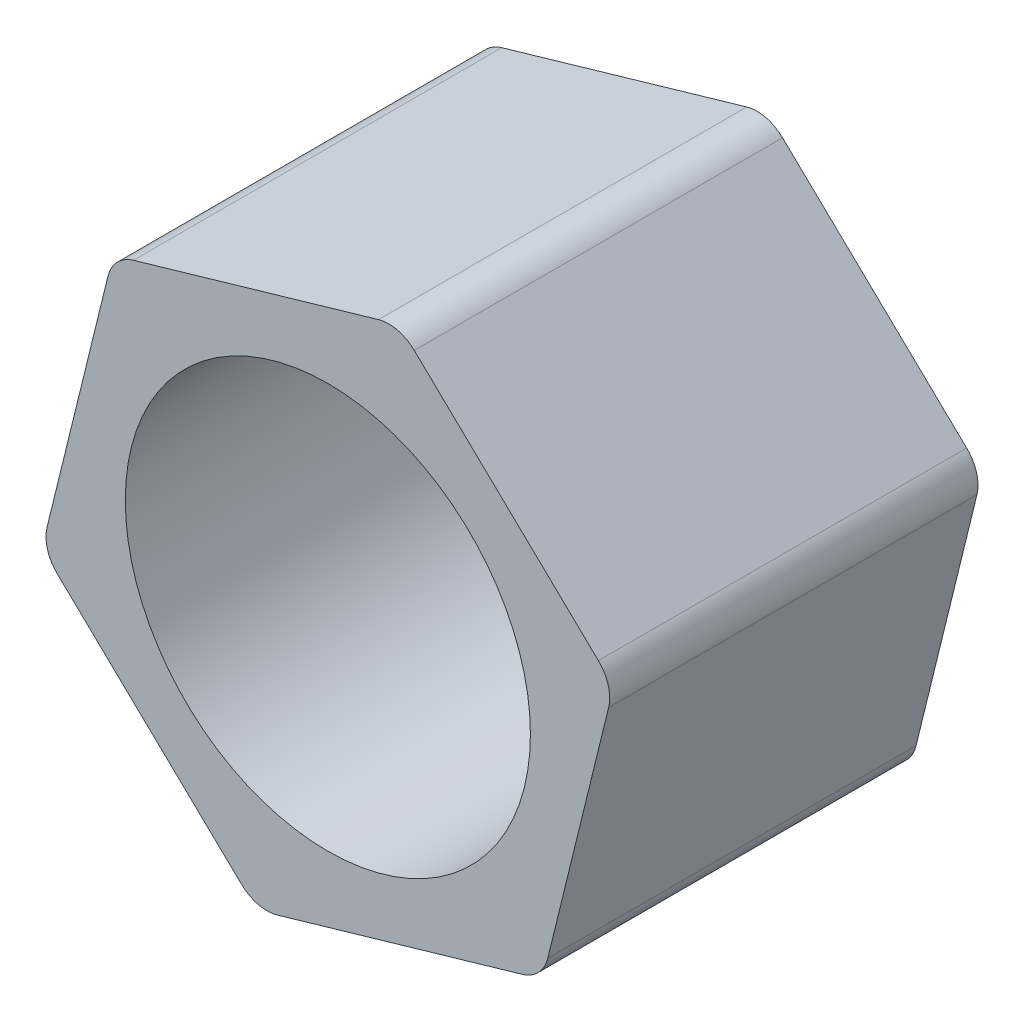
ISO-10303-21;
HEADER;
FILE_DESCRIPTION(('STEP AP214'),'2;1');
FILE_NAME('part.step','',(''),(''),'','','');
FILE_SCHEMA(('AUTOMOTIVE_DESIGN { 1 0 10303 214 1 1 1 1 }'));
ENDSEC;
DATA;
#1=APPLICATION_CONTEXT('core data for automotive mechanical design processes');
#2=APPLICATION_PROTOCOL_DEFINITION('international standard','automotive_design',2000,#1);
#3=PRODUCT_CONTEXT('',#1,'mechanical');
#4=PRODUCT('Part','Part','',(#3));
#5=PRODUCT_RELATED_PRODUCT_CATEGORY('part','',(#4));
#6=PRODUCT_DEFINITION_FORMATION('','',#4);
#7=PRODUCT_DEFINITION_CONTEXT('part definition',#1,'design');
#8=PRODUCT_DEFINITION('design','',#6,#7);
#9=PRODUCT_DEFINITION_SHAPE('','',#8);
#10=(LENGTH_UNIT() NAMED_UNIT(*) SI_UNIT(.MILLI.,.METRE.));
#11=(NAMED_UNIT(*) PLANE_ANGLE_UNIT() SI_UNIT($,.RADIAN.));
#12=(NAMED_UNIT(*) SI_UNIT($,.STERADIAN.) SOLID_ANGLE_UNIT());
#13=UNCERTAINTY_MEASURE_WITH_UNIT(LENGTH_MEASURE(1.E-05),#10,'distance_accuracy_value','');
#14=(GEOMETRIC_REPRESENTATION_CONTEXT(3) GLOBAL_UNCERTAINTY_ASSIGNED_CONTEXT((#13)) GLOBAL_UNIT_ASSIGNED_CONTEXT((#10,
#11,#12)) REPRESENTATION_CONTEXT('',''));
#15=CARTESIAN_POINT('',(0.,0.,0.));
#16=DIRECTION('',(0.,0.,1.));
#17=DIRECTION('',(1.,0.,0.));
#18=AXIS2_PLACEMENT_3D('',#15,#16,#17);
#19=CARTESIAN_POINT('',(0.,0.,20.));
#20=DIRECTION('',(0.,0.,1.));
#21=DIRECTION('',(1.,0.,0.));
#22=AXIS2_PLACEMENT_3D('',#19,#20,#21);
#23=PLANE('',#22);
#24=DIRECTION('',(0.721661581007449,-0.692246027433765,0.));
#25=VECTOR('',#24,1.);
#26=CARTESIAN_POINT('',(-15.5245654968912,-4.50790411012362,20.));
#27=LINE('',#26,#25);
#28=CARTESIAN_POINT('',(-14.6912624807742,-5.30724097069229,20.));
#29=VERTEX_POINT('',#28);
#30=CARTESIAN_POINT('',(-4.69162628737118,-14.8992832975163,20.));
#31=VERTEX_POINT('',#30);
#32=EDGE_CURVE('E217',#29,#31,#27,.T.);
#33=ORIENTED_EDGE('',*,*,#32,.T.);
#34=CARTESIAN_POINT('',(-3.30713423250365,-13.4559601355014,20.));
#35=DIRECTION('',(0.,0.,1.));
#36=DIRECTION('',(1.,0.,0.));
#37=AXIS2_PLACEMENT_3D('',#34,#35,#36);
#38=CIRCLE('',#37,2.);
#39=CARTESIAN_POINT('',(-2.74942573576203,-15.3766270073618,20.));
#40=VERTEX_POINT('',#39);
#41=EDGE_CURVE('E273',#31,#40,#38,.T.);
#42=ORIENTED_EDGE('',*,*,#41,.T.);
#43=DIRECTION('',(0.960333435930224,0.27885424837081,0.));
#44=VECTOR('',#43,1.);
#45=CARTESIAN_POINT('',(-3.85832327125425,-15.698620158085,20.));
#46=LINE('',#45,#44);
#47=CARTESIAN_POINT('',(10.5573446901447,-11.5127091986844,20.));
#48=VERTEX_POINT('',#47);
#49=EDGE_CURVE('E192',#40,#48,#46,.T.);
#50=ORIENTED_EDGE('',*,*,#49,.T.);
#51=CARTESIAN_POINT('',(9.99963619340309,-9.59204232682399,20.));
#52=DIRECTION('',(0.,0.,1.));
#53=DIRECTION('',(1.,0.,0.));
#54=AXIS2_PLACEMENT_3D('',#51,#52,#53);
#55=CIRCLE('',#54,2.);
#56=CARTESIAN_POINT('',(11.9418367450122,-10.0693860366695,20.));
#57=VERTEX_POINT('',#56);
#58=EDGE_CURVE('E267',#48,#57,#55,.T.);
#59=ORIENTED_EDGE('',*,*,#58,.T.);
#60=DIRECTION('',(0.238671854922775,0.971100275804575,0.));
#61=VECTOR('',#60,1.);
#62=CARTESIAN_POINT('',(11.6662422256369,-11.1907160479613,20.));
#63=LINE('',#62,#61);
#64=CARTESIAN_POINT('',(15.2489709775159,3.38657409883183,20.));
#65=VERTEX_POINT('',#64);
#66=EDGE_CURVE('E307',#57,#65,#63,.T.);
#67=ORIENTED_EDGE('',*,*,#66,.T.);
#68=CARTESIAN_POINT('',(13.3067704259067,3.86391780867738,20.));
#69=DIRECTION('',(0.,0.,1.));
#70=DIRECTION('',(1.,0.,0.));
#71=AXIS2_PLACEMENT_3D('',#68,#69,#70);
#72=CIRCLE('',#71,2.);
#73=CARTESIAN_POINT('',(14.6912624807743,5.30724097069228,20.));
#74=VERTEX_POINT('',#73);
#75=EDGE_CURVE('E317',#65,#74,#72,.T.);
#76=ORIENTED_EDGE('',*,*,#75,.T.);
#77=DIRECTION('',(-0.721661581007449,0.692246027433765,0.));
#78=VECTOR('',#77,1.);
#79=CARTESIAN_POINT('',(15.5245654968912,4.50790411012362,20.));
#80=LINE('',#79,#78);
#81=CARTESIAN_POINT('',(4.69162628737118,14.8992832975163,20.));
#82=VERTEX_POINT('',#81);
#83=EDGE_CURVE('E256',#74,#82,#80,.T.);
#84=ORIENTED_EDGE('',*,*,#83,.T.);
#85=CARTESIAN_POINT('',(3.30713423250365,13.4559601355014,20.));
#86=DIRECTION('',(0.,0.,1.));
#87=DIRECTION('',(1.,0.,0.));
#88=AXIS2_PLACEMENT_3D('',#85,#86,#87);
#89=CIRCLE('',#88,2.);
#90=CARTESIAN_POINT('',(2.74942573576203,15.3766270073618,20.));
#91=VERTEX_POINT('',#90);
#92=EDGE_CURVE('E320',#82,#91,#89,.T.);
#93=ORIENTED_EDGE('',*,*,#92,.T.);
#94=DIRECTION('',(-0.960333435930225,-0.27885424837081,0.));
#95=VECTOR('',#94,1.);
#96=CARTESIAN_POINT('',(3.85832327125426,15.6986201580849,20.));
#97=LINE('',#96,#95);
#98=CARTESIAN_POINT('',(-10.5573446901447,11.5127091986844,20.));
#99=VERTEX_POINT('',#98);
#100=EDGE_CURVE('E252',#91,#99,#97,.T.);
#101=ORIENTED_EDGE('',*,*,#100,.T.);
#102=CARTESIAN_POINT('',(-9.99963619340308,9.592042326824,20.));
#103=DIRECTION('',(0.,0.,1.));
#104=DIRECTION('',(1.,0.,0.));
#105=AXIS2_PLACEMENT_3D('',#102,#103,#104);
#106=CIRCLE('',#105,2.);
#107=CARTESIAN_POINT('',(-11.9418367450122,10.0693860366695,20.));
#108=VERTEX_POINT('',#107);
#109=EDGE_CURVE('E82',#99,#108,#106,.T.);
#110=ORIENTED_EDGE('',*,*,#109,.T.);
#111=DIRECTION('',(-0.238671854922776,-0.971100275804575,0.));
#112=VECTOR('',#111,1.);
#113=CARTESIAN_POINT('',(-11.6662422256369,11.1907160479613,20.));
#114=LINE('',#113,#112);
#115=CARTESIAN_POINT('',(-15.2489709775159,-3.38657409883184,20.));
#116=VERTEX_POINT('',#115);
#117=EDGE_CURVE('E248',#108,#116,#114,.T.);
#118=ORIENTED_EDGE('',*,*,#117,.T.);
#119=CARTESIAN_POINT('',(-13.3067704259067,-3.86391780867739,20.));
#120=DIRECTION('',(0.,0.,1.));
#121=DIRECTION('',(1.,0.,0.));
#122=AXIS2_PLACEMENT_3D('',#119,#120,#121);
#123=CIRCLE('',#122,2.);
#124=EDGE_CURVE('E266',#116,#29,#123,.T.);
#125=ORIENTED_EDGE('',*,*,#124,.T.);
#126=EDGE_LOOP('',(#33,#42,#50,#59,#67,#76,#84,#93,#101,#110,#118,#125));
#127=FACE_BOUND('',#126,.T.);
#128=CARTESIAN_POINT('',(0.,0.,20.));
#129=DIRECTION('',(0.,0.,1.));
#130=DIRECTION('',(1.,0.,0.));
#131=AXIS2_PLACEMENT_3D('',#128,#129,#130);
#132=CIRCLE('',#131,11.);
#133=CARTESIAN_POINT('',(11.,0.,20.));
#134=VERTEX_POINT('',#133);
#135=EDGE_CURVE('E203',#134,#134,#132,.T.);
#136=ORIENTED_EDGE('',*,*,#135,.F.);
#137=EDGE_LOOP('',(#136));
#138=FACE_BOUND('',#137,.T.);
#139=ADVANCED_FACE('F53',(#127,#138),#23,.T.);
#140=CARTESIAN_POINT('',(0.,0.,0.));
#141=DIRECTION('',(0.,0.,1.));
#142=DIRECTION('',(1.,0.,0.));
#143=AXIS2_PLACEMENT_3D('',#140,#141,#142);
#144=PLANE('',#143);
#145=DIRECTION('',(0.960333435930224,0.27885424837081,0.));
#146=VECTOR('',#145,1.);
#147=CARTESIAN_POINT('',(-3.85832327125425,-15.698620158085,0.));
#148=LINE('',#147,#146);
#149=CARTESIAN_POINT('',(-2.74942573576203,-15.3766270073618,0.));
#150=VERTEX_POINT('',#149);
#151=CARTESIAN_POINT('',(10.5573446901447,-11.5127091986844,0.));
#152=VERTEX_POINT('',#151);
#153=EDGE_CURVE('E189',#150,#152,#148,.T.);
#154=ORIENTED_EDGE('',*,*,#153,.F.);
#155=CARTESIAN_POINT('',(-3.30713423250365,-13.4559601355014,0.));
#156=DIRECTION('',(0.,0.,1.));
#157=DIRECTION('',(1.,0.,0.));
#158=AXIS2_PLACEMENT_3D('',#155,#156,#157);
#159=CIRCLE('',#158,2.);
#160=CARTESIAN_POINT('',(-4.69162628737118,-14.8992832975163,0.));
#161=VERTEX_POINT('',#160);
#162=EDGE_CURVE('E171',#150,#161,#159,.F.);
#163=ORIENTED_EDGE('',*,*,#162,.T.);
#164=DIRECTION('',(0.721661581007449,-0.692246027433765,0.));
#165=VECTOR('',#164,1.);
#166=CARTESIAN_POINT('',(-15.5245654968912,-4.50790411012362,0.));
#167=LINE('',#166,#165);
#168=CARTESIAN_POINT('',(-14.6912624807742,-5.30724097069229,0.));
#169=VERTEX_POINT('',#168);
#170=EDGE_CURVE('E237',#169,#161,#167,.T.);
#171=ORIENTED_EDGE('',*,*,#170,.F.);
#172=CARTESIAN_POINT('',(-13.3067704259067,-3.86391780867739,0.));
#173=DIRECTION('',(0.,0.,1.));
#174=DIRECTION('',(1.,0.,0.));
#175=AXIS2_PLACEMENT_3D('',#172,#173,#174);
#176=CIRCLE('',#175,2.);
#177=CARTESIAN_POINT('',(-15.2489709775159,-3.38657409883184,0.));
#178=VERTEX_POINT('',#177);
#179=EDGE_CURVE('E183',#169,#178,#176,.F.);
#180=ORIENTED_EDGE('',*,*,#179,.T.);
#181=DIRECTION('',(-0.238671854922776,-0.971100275804575,0.));
#182=VECTOR('',#181,1.);
#183=CARTESIAN_POINT('',(-11.6662422256369,11.1907160479613,0.));
#184=LINE('',#183,#182);
#185=CARTESIAN_POINT('',(-11.9418367450122,10.0693860366695,0.));
#186=VERTEX_POINT('',#185);
#187=EDGE_CURVE('E232',#186,#178,#184,.T.);
#188=ORIENTED_EDGE('',*,*,#187,.F.);
#189=CARTESIAN_POINT('',(-9.99963619340308,9.592042326824,0.));
#190=DIRECTION('',(0.,0.,1.));
#191=DIRECTION('',(1.,0.,0.));
#192=AXIS2_PLACEMENT_3D('',#189,#190,#191);
#193=CIRCLE('',#192,2.);
#194=CARTESIAN_POINT('',(-10.5573446901447,11.5127091986844,0.));
#195=VERTEX_POINT('',#194);
#196=EDGE_CURVE('E290',#186,#195,#193,.F.);
#197=ORIENTED_EDGE('',*,*,#196,.T.);
#198=DIRECTION('',(-0.960333435930225,-0.27885424837081,0.));
#199=VECTOR('',#198,1.);
#200=CARTESIAN_POINT('',(3.85832327125426,15.6986201580849,0.));
#201=LINE('',#200,#199);
#202=CARTESIAN_POINT('',(2.74942573576203,15.3766270073618,0.));
#203=VERTEX_POINT('',#202);
#204=EDGE_CURVE('E227',#203,#195,#201,.T.);
#205=ORIENTED_EDGE('',*,*,#204,.F.);
#206=CARTESIAN_POINT('',(3.30713423250365,13.4559601355014,0.));
#207=DIRECTION('',(0.,0.,1.));
#208=DIRECTION('',(1.,0.,0.));
#209=AXIS2_PLACEMENT_3D('',#206,#207,#208);
#210=CIRCLE('',#209,2.);
#211=CARTESIAN_POINT('',(4.69162628737118,14.8992832975163,0.));
#212=VERTEX_POINT('',#211);
#213=EDGE_CURVE('E194',#203,#212,#210,.F.);
#214=ORIENTED_EDGE('',*,*,#213,.T.);
#215=DIRECTION('',(-0.721661581007449,0.692246027433765,0.));
#216=VECTOR('',#215,1.);
#217=CARTESIAN_POINT('',(15.5245654968912,4.50790411012362,0.));
#218=LINE('',#217,#216);
#219=CARTESIAN_POINT('',(14.6912624807743,5.30724097069228,0.));
#220=VERTEX_POINT('',#219);
#221=EDGE_CURVE('E209',#220,#212,#218,.T.);
#222=ORIENTED_EDGE('',*,*,#221,.F.);
#223=CARTESIAN_POINT('',(13.3067704259067,3.86391780867738,0.));
#224=DIRECTION('',(0.,0.,1.));
#225=DIRECTION('',(1.,0.,0.));
#226=AXIS2_PLACEMENT_3D('',#223,#224,#225);
#227=CIRCLE('',#226,2.);
#228=CARTESIAN_POINT('',(15.2489709775159,3.38657409883183,0.));
#229=VERTEX_POINT('',#228);
#230=EDGE_CURVE('E285',#220,#229,#227,.F.);
#231=ORIENTED_EDGE('',*,*,#230,.T.);
#232=DIRECTION('',(0.238671854922775,0.971100275804575,0.));
#233=VECTOR('',#232,1.);
#234=CARTESIAN_POINT('',(11.6662422256369,-11.1907160479613,0.));
#235=LINE('',#234,#233);
#236=CARTESIAN_POINT('',(11.9418367450122,-10.0693860366695,0.));
#237=VERTEX_POINT('',#236);
#238=EDGE_CURVE('E202',#237,#229,#235,.T.);
#239=ORIENTED_EDGE('',*,*,#238,.F.);
#240=CARTESIAN_POINT('',(9.99963619340309,-9.59204232682399,0.));
#241=DIRECTION('',(0.,0.,1.));
#242=DIRECTION('',(1.,0.,0.));
#243=AXIS2_PLACEMENT_3D('',#240,#241,#242);
#244=CIRCLE('',#243,2.);
#245=EDGE_CURVE('E200',#237,#152,#244,.F.);
#246=ORIENTED_EDGE('',*,*,#245,.T.);
#247=EDGE_LOOP('',(#154,#163,#171,#180,#188,#197,#205,#214,#222,#231,#239,#246));
#248=FACE_BOUND('',#247,.T.);
#249=CARTESIAN_POINT('',(0.,0.,0.));
#250=DIRECTION('',(0.,0.,1.));
#251=DIRECTION('',(1.,0.,0.));
#252=AXIS2_PLACEMENT_3D('',#249,#250,#251);
#253=CIRCLE('',#252,11.);
#254=CARTESIAN_POINT('',(11.,0.,0.));
#255=VERTEX_POINT('',#254);
#256=EDGE_CURVE('E213',#255,#255,#253,.T.);
#257=ORIENTED_EDGE('',*,*,#256,.T.);
#258=EDGE_LOOP('',(#257));
#259=FACE_BOUND('',#258,.T.);
#260=ADVANCED_FACE('F197',(#248,#259),#144,.F.);
#261=CARTESIAN_POINT('',(-3.85832327125425,-15.698620158085,20.));
#262=DIRECTION('',(-0.27885424837081,0.960333435930225,0.));
#263=DIRECTION('',(-0.960333435930225,-0.27885424837081,0.));
#264=AXIS2_PLACEMENT_3D('',#261,#262,#263);
#265=PLANE('',#264);
#266=ORIENTED_EDGE('',*,*,#49,.F.);
#267=DIRECTION('',(0.,0.,-1.));
#268=VECTOR('',#267,1.);
#269=CARTESIAN_POINT('',(-2.74942573576203,-15.3766270073618,20.));
#270=LINE('',#269,#268);
#271=EDGE_CURVE('E175',#40,#150,#270,.T.);
#272=ORIENTED_EDGE('',*,*,#271,.T.);
#273=ORIENTED_EDGE('',*,*,#153,.T.);
#274=DIRECTION('',(0.,0.,-1.));
#275=VECTOR('',#274,1.);
#276=CARTESIAN_POINT('',(10.5573446901447,-11.5127091986844,20.));
#277=LINE('',#276,#275);
#278=EDGE_CURVE('E195',#152,#48,#277,.F.);
#279=ORIENTED_EDGE('',*,*,#278,.T.);
#280=EDGE_LOOP('',(#266,#272,#273,#279));
#281=FACE_BOUND('',#280,.T.);
#282=ADVANCED_FACE('F188',(#281),#265,.F.);
#283=CARTESIAN_POINT('',(11.6662422256369,-11.1907160479613,20.));
#284=DIRECTION('',(-0.971100275804575,0.238671854922775,0.));
#285=DIRECTION('',(-0.238671854922775,-0.971100275804575,0.));
#286=AXIS2_PLACEMENT_3D('',#283,#284,#285);
#287=PLANE('',#286);
#288=ORIENTED_EDGE('',*,*,#66,.F.);
#289=DIRECTION('',(0.,0.,-1.));
#290=VECTOR('',#289,1.);
#291=CARTESIAN_POINT('',(11.9418367450122,-10.0693860366695,20.));
#292=LINE('',#291,#290);
#293=EDGE_CURVE('E335',#57,#237,#292,.T.);
#294=ORIENTED_EDGE('',*,*,#293,.T.);
#295=ORIENTED_EDGE('',*,*,#238,.T.);
#296=DIRECTION('',(0.,0.,-1.));
#297=VECTOR('',#296,1.);
#298=CARTESIAN_POINT('',(15.2489709775159,3.38657409883183,20.));
#299=LINE('',#298,#297);
#300=EDGE_CURVE('E333',#229,#65,#299,.F.);
#301=ORIENTED_EDGE('',*,*,#300,.T.);
#302=EDGE_LOOP('',(#288,#294,#295,#301));
#303=FACE_BOUND('',#302,.T.);
#304=ADVANCED_FACE('F414',(#303),#287,.F.);
#305=CARTESIAN_POINT('',(15.5245654968912,4.50790411012362,20.));
#306=DIRECTION('',(-0.692246027433765,-0.721661581007449,0.));
#307=DIRECTION('',(0.721661581007449,-0.692246027433765,0.));
#308=AXIS2_PLACEMENT_3D('',#305,#306,#307);
#309=PLANE('',#308);
#310=ORIENTED_EDGE('',*,*,#83,.F.);
#311=DIRECTION('',(0.,0.,-1.));
#312=VECTOR('',#311,1.);
#313=CARTESIAN_POINT('',(14.6912624807743,5.30724097069228,20.));
#314=LINE('',#313,#312);
#315=EDGE_CURVE('E12',#74,#220,#314,.T.);
#316=ORIENTED_EDGE('',*,*,#315,.T.);
#317=ORIENTED_EDGE('',*,*,#221,.T.);
#318=DIRECTION('',(0.,0.,-1.));
#319=VECTOR('',#318,1.);
#320=CARTESIAN_POINT('',(4.69162628737118,14.8992832975163,20.));
#321=LINE('',#320,#319);
#322=EDGE_CURVE('E64',#212,#82,#321,.F.);
#323=ORIENTED_EDGE('',*,*,#322,.T.);
#324=EDGE_LOOP('',(#310,#316,#317,#323));
#325=FACE_BOUND('',#324,.T.);
#326=ADVANCED_FACE('F347',(#325),#309,.F.);
#327=CARTESIAN_POINT('',(3.85832327125426,15.6986201580849,20.));
#328=DIRECTION('',(0.27885424837081,-0.960333435930225,0.));
#329=DIRECTION('',(0.960333435930225,0.27885424837081,0.));
#330=AXIS2_PLACEMENT_3D('',#327,#328,#329);
#331=PLANE('',#330);
#332=ORIENTED_EDGE('',*,*,#204,.T.);
#333=DIRECTION('',(0.,0.,-1.));
#334=VECTOR('',#333,1.);
#335=CARTESIAN_POINT('',(-10.5573446901447,11.5127091986844,20.));
#336=LINE('',#335,#334);
#337=EDGE_CURVE('E330',#195,#99,#336,.F.);
#338=ORIENTED_EDGE('',*,*,#337,.T.);
#339=ORIENTED_EDGE('',*,*,#100,.F.);
#340=DIRECTION('',(0.,0.,-1.));
#341=VECTOR('',#340,1.);
#342=CARTESIAN_POINT('',(2.74942573576203,15.3766270073618,20.));
#343=LINE('',#342,#341);
#344=EDGE_CURVE('E325',#91,#203,#343,.T.);
#345=ORIENTED_EDGE('',*,*,#344,.T.);
#346=EDGE_LOOP('',(#332,#338,#339,#345));
#347=FACE_BOUND('',#346,.T.);
#348=ADVANCED_FACE('F360',(#347),#331,.F.);
#349=CARTESIAN_POINT('',(-11.6662422256369,11.1907160479613,20.));
#350=DIRECTION('',(0.971100275804575,-0.238671854922776,0.));
#351=DIRECTION('',(0.238671854922776,0.971100275804575,0.));
#352=AXIS2_PLACEMENT_3D('',#349,#350,#351);
#353=PLANE('',#352);
#354=ORIENTED_EDGE('',*,*,#187,.T.);
#355=DIRECTION('',(0.,0.,-1.));
#356=VECTOR('',#355,1.);
#357=CARTESIAN_POINT('',(-15.2489709775159,-3.38657409883184,20.));
#358=LINE('',#357,#356);
#359=EDGE_CURVE('E74',#178,#116,#358,.F.);
#360=ORIENTED_EDGE('',*,*,#359,.T.);
#361=ORIENTED_EDGE('',*,*,#117,.F.);
#362=DIRECTION('',(0.,0.,-1.));
#363=VECTOR('',#362,1.);
#364=CARTESIAN_POINT('',(-11.9418367450122,10.0693860366695,20.));
#365=LINE('',#364,#363);
#366=EDGE_CURVE('E276',#108,#186,#365,.T.);
#367=ORIENTED_EDGE('',*,*,#366,.T.);
#368=EDGE_LOOP('',(#354,#360,#361,#367));
#369=FACE_BOUND('',#368,.T.);
#370=ADVANCED_FACE('F367',(#369),#353,.F.);
#371=CARTESIAN_POINT('',(-15.5245654968912,-4.50790411012362,20.));
#372=DIRECTION('',(0.692246027433765,0.721661581007449,0.));
#373=DIRECTION('',(-0.721661581007449,0.692246027433765,0.));
#374=AXIS2_PLACEMENT_3D('',#371,#372,#373);
#375=PLANE('',#374);
#376=ORIENTED_EDGE('',*,*,#170,.T.);
#377=DIRECTION('',(0.,0.,-1.));
#378=VECTOR('',#377,1.);
#379=CARTESIAN_POINT('',(-4.69162628737117,-14.8992832975163,20.));
#380=LINE('',#379,#378);
#381=EDGE_CURVE('E176',#161,#31,#380,.F.);
#382=ORIENTED_EDGE('',*,*,#381,.T.);
#383=ORIENTED_EDGE('',*,*,#32,.F.);
#384=DIRECTION('',(0.,0.,-1.));
#385=VECTOR('',#384,1.);
#386=CARTESIAN_POINT('',(-14.6912624807742,-5.30724097069229,20.));
#387=LINE('',#386,#385);
#388=EDGE_CURVE('E182',#29,#169,#387,.T.);
#389=ORIENTED_EDGE('',*,*,#388,.T.);
#390=EDGE_LOOP('',(#376,#382,#383,#389));
#391=FACE_BOUND('',#390,.T.);
#392=ADVANCED_FACE('F421',(#391),#375,.F.);
#393=CARTESIAN_POINT('',(0.,0.,20.));
#394=DIRECTION('',(0.,0.,-1.));
#395=DIRECTION('',(-1.,0.,0.));
#396=AXIS2_PLACEMENT_3D('',#393,#394,#395);
#397=CYLINDRICAL_SURFACE('',#396,11.);
#398=ORIENTED_EDGE('',*,*,#135,.T.);
#399=EDGE_LOOP('',(#398));
#400=FACE_BOUND('',#399,.T.);
#401=ORIENTED_EDGE('',*,*,#256,.F.);
#402=EDGE_LOOP('',(#401));
#403=FACE_BOUND('',#402,.T.);
#404=ADVANCED_FACE('F431',(#400,#403),#397,.F.);
#405=CARTESIAN_POINT('',(-3.30713423250365,-13.4559601355014,20.));
#406=DIRECTION('',(0.,0.,-1.));
#407=DIRECTION('',(-1.,0.,0.));
#408=AXIS2_PLACEMENT_3D('',#405,#406,#407);
#409=CYLINDRICAL_SURFACE('',#408,2.);
#410=ORIENTED_EDGE('',*,*,#41,.F.);
#411=ORIENTED_EDGE('',*,*,#381,.F.);
#412=ORIENTED_EDGE('',*,*,#162,.F.);
#413=ORIENTED_EDGE('',*,*,#271,.F.);
#414=EDGE_LOOP('',(#410,#411,#412,#413));
#415=FACE_BOUND('',#414,.T.);
#416=ADVANCED_FACE('F174',(#415),#409,.T.);
#417=CARTESIAN_POINT('',(-13.3067704259067,-3.86391780867739,20.));
#418=DIRECTION('',(0.,0.,-1.));
#419=DIRECTION('',(-1.,0.,0.));
#420=AXIS2_PLACEMENT_3D('',#417,#418,#419);
#421=CYLINDRICAL_SURFACE('',#420,2.);
#422=ORIENTED_EDGE('',*,*,#124,.F.);
#423=ORIENTED_EDGE('',*,*,#359,.F.);
#424=ORIENTED_EDGE('',*,*,#179,.F.);
#425=ORIENTED_EDGE('',*,*,#388,.F.);
#426=EDGE_LOOP('',(#422,#423,#424,#425));
#427=FACE_BOUND('',#426,.T.);
#428=ADVANCED_FACE('F423',(#427),#421,.T.);
#429=CARTESIAN_POINT('',(-9.99963619340308,9.592042326824,20.));
#430=DIRECTION('',(0.,0.,-1.));
#431=DIRECTION('',(-1.,0.,0.));
#432=AXIS2_PLACEMENT_3D('',#429,#430,#431);
#433=CYLINDRICAL_SURFACE('',#432,2.);
#434=ORIENTED_EDGE('',*,*,#109,.F.);
#435=ORIENTED_EDGE('',*,*,#337,.F.);
#436=ORIENTED_EDGE('',*,*,#196,.F.);
#437=ORIENTED_EDGE('',*,*,#366,.F.);
#438=EDGE_LOOP('',(#434,#435,#436,#437));
#439=FACE_BOUND('',#438,.T.);
#440=ADVANCED_FACE('F366',(#439),#433,.T.);
#441=CARTESIAN_POINT('',(9.99963619340309,-9.59204232682399,20.));
#442=DIRECTION('',(0.,0.,-1.));
#443=DIRECTION('',(-1.,0.,0.));
#444=AXIS2_PLACEMENT_3D('',#441,#442,#443);
#445=CYLINDRICAL_SURFACE('',#444,2.);
#446=ORIENTED_EDGE('',*,*,#58,.F.);
#447=ORIENTED_EDGE('',*,*,#278,.F.);
#448=ORIENTED_EDGE('',*,*,#245,.F.);
#449=ORIENTED_EDGE('',*,*,#293,.F.);
#450=EDGE_LOOP('',(#446,#447,#448,#449));
#451=FACE_BOUND('',#450,.T.);
#452=ADVANCED_FACE('F416',(#451),#445,.T.);
#453=CARTESIAN_POINT('',(13.3067704259067,3.86391780867738,20.));
#454=DIRECTION('',(0.,0.,-1.));
#455=DIRECTION('',(-1.,0.,0.));
#456=AXIS2_PLACEMENT_3D('',#453,#454,#455);
#457=CYLINDRICAL_SURFACE('',#456,2.);
#458=ORIENTED_EDGE('',*,*,#75,.F.);
#459=ORIENTED_EDGE('',*,*,#300,.F.);
#460=ORIENTED_EDGE('',*,*,#230,.F.);
#461=ORIENTED_EDGE('',*,*,#315,.F.);
#462=EDGE_LOOP('',(#458,#459,#460,#461));
#463=FACE_BOUND('',#462,.T.);
#464=ADVANCED_FACE('F505',(#463),#457,.T.);
#465=CARTESIAN_POINT('',(3.30713423250365,13.4559601355014,20.));
#466=DIRECTION('',(0.,0.,-1.));
#467=DIRECTION('',(-1.,0.,0.));
#468=AXIS2_PLACEMENT_3D('',#465,#466,#467);
#469=CYLINDRICAL_SURFACE('',#468,2.);
#470=ORIENTED_EDGE('',*,*,#92,.F.);
#471=ORIENTED_EDGE('',*,*,#322,.F.);
#472=ORIENTED_EDGE('',*,*,#213,.F.);
#473=ORIENTED_EDGE('',*,*,#344,.F.);
#474=EDGE_LOOP('',(#470,#471,#472,#473));
#475=FACE_BOUND('',#474,.T.);
#476=ADVANCED_FACE('F56',(#475),#469,.T.);
#477=CLOSED_SHELL('',(#139,#260,#282,#304,#326,#348,#370,#392,#404,#416,#428,#440,#452,#464,#476));
#478=MANIFOLD_SOLID_BREP('B2',#477);
#479=ADVANCED_BREP_SHAPE_REPRESENTATION('',(#18,#478),#14);
#480=SHAPE_DEFINITION_REPRESENTATION(#9,#479);
ENDSEC;
END-ISO-10303-21;
